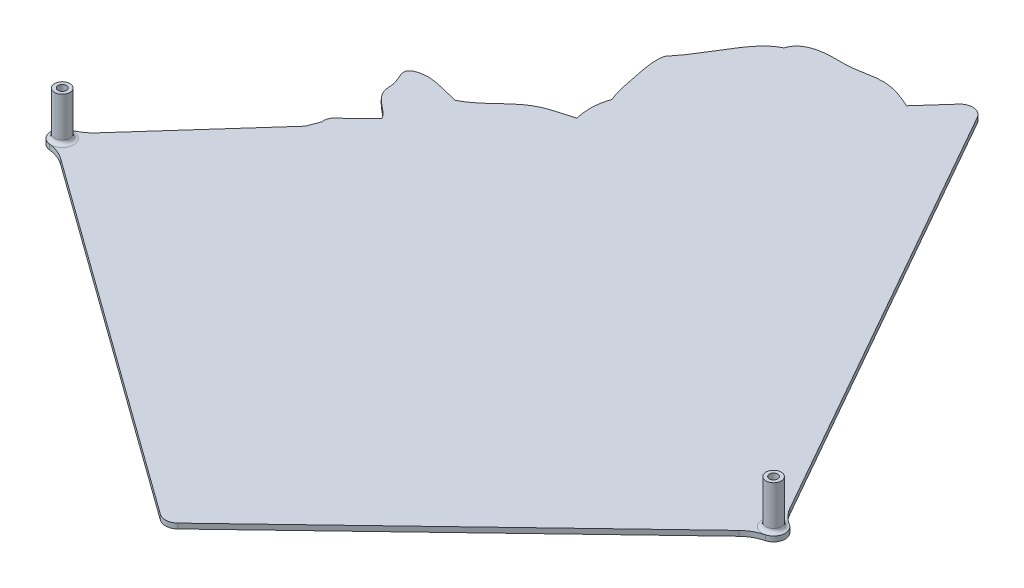
ISO-10303-21;
HEADER;
FILE_DESCRIPTION(('STEP AP214'),'2;1');
FILE_NAME('part.step','',(''),(''),'','','');
FILE_SCHEMA(('AUTOMOTIVE_DESIGN { 1 0 10303 214 1 1 1 1 }'));
ENDSEC;
DATA;
#1=APPLICATION_CONTEXT('core data for automotive mechanical design processes');
#2=APPLICATION_PROTOCOL_DEFINITION('international standard','automotive_design',2000,#1);
#3=PRODUCT_CONTEXT('',#1,'mechanical');
#4=PRODUCT('Part','Part','',(#3));
#5=PRODUCT_RELATED_PRODUCT_CATEGORY('part','',(#4));
#6=PRODUCT_DEFINITION_FORMATION('','',#4);
#7=PRODUCT_DEFINITION_CONTEXT('part definition',#1,'design');
#8=PRODUCT_DEFINITION('design','',#6,#7);
#9=PRODUCT_DEFINITION_SHAPE('','',#8);
#10=(LENGTH_UNIT() NAMED_UNIT(*) SI_UNIT(.MILLI.,.METRE.));
#11=(NAMED_UNIT(*) PLANE_ANGLE_UNIT() SI_UNIT($,.RADIAN.));
#12=(NAMED_UNIT(*) SI_UNIT($,.STERADIAN.) SOLID_ANGLE_UNIT());
#13=UNCERTAINTY_MEASURE_WITH_UNIT(LENGTH_MEASURE(1.E-05),#10,'distance_accuracy_value','');
#14=(GEOMETRIC_REPRESENTATION_CONTEXT(3) GLOBAL_UNCERTAINTY_ASSIGNED_CONTEXT((#13)) GLOBAL_UNIT_ASSIGNED_CONTEXT((#10,
#11,#12)) REPRESENTATION_CONTEXT('',''));
#15=CARTESIAN_POINT('',(0.,0.,0.));
#16=DIRECTION('',(0.,0.,1.));
#17=DIRECTION('',(1.,0.,0.));
#18=AXIS2_PLACEMENT_3D('',#15,#16,#17);
#19=CARTESIAN_POINT('',(50.312065061751,143.565722281243,204.420613873593));
#20=CARTESIAN_POINT('',(49.8157199251509,143.565722281243,202.125692191697));
#21=CARTESIAN_POINT('',(51.5600447655036,143.565722281243,200.071289123139));
#22=CARTESIAN_POINT('',(53.4054148893703,143.565722281243,199.000816342688));
#23=B_SPLINE_CURVE_WITH_KNOTS('',3,(#19,#20,#21,#22),.UNSPECIFIED.,.F.,.F.,(4,4),(0.,1.),.UNSPECIFIED.);
#24=DIRECTION('',(0.,-1.,0.));
#25=VECTOR('',#24,1.);
#26=SURFACE_OF_LINEAR_EXTRUSION('',#23,#25);
#27=CARTESIAN_POINT('',(50.312065061751,141.565722281243,204.420613873593));
#28=CARTESIAN_POINT('',(49.8157199251509,141.565722281243,202.125692191697));
#29=CARTESIAN_POINT('',(51.5600447655036,141.565722281243,200.071289123139));
#30=CARTESIAN_POINT('',(53.4054148893703,141.565722281243,199.000816342688));
#31=B_SPLINE_CURVE_WITH_KNOTS('',3,(#27,#28,#29,#30),.UNSPECIFIED.,.F.,.F.,(4,4),(0.,1.),.UNSPECIFIED.);
#32=CARTESIAN_POINT('',(50.312065061751,141.565722281243,204.420613873593));
#33=VERTEX_POINT('',#32);
#34=CARTESIAN_POINT('',(53.4054149393439,141.565722281243,199.000816290674));
#35=VERTEX_POINT('',#34);
#36=EDGE_CURVE('E225',#33,#35,#31,.T.);
#37=ORIENTED_EDGE('',*,*,#36,.F.);
#38=DIRECTION('',(0.,-1.,0.));
#39=VECTOR('',#38,1.);
#40=CARTESIAN_POINT('',(50.312065061751,143.565722281243,204.420613873593));
#41=LINE('',#40,#39);
#42=CARTESIAN_POINT('',(50.312065061751,143.565722281243,204.420613873593));
#43=VERTEX_POINT('',#42);
#44=EDGE_CURVE('E57',#43,#33,#41,.T.);
#45=ORIENTED_EDGE('',*,*,#44,.F.);
#46=CARTESIAN_POINT('',(53.4054149393439,143.565722281243,199.000816290674));
#47=VERTEX_POINT('',#46);
#48=EDGE_CURVE('E329',#43,#47,#23,.T.);
#49=ORIENTED_EDGE('',*,*,#48,.T.);
#50=DIRECTION('',(0.,-1.,0.));
#51=VECTOR('',#50,1.);
#52=CARTESIAN_POINT('',(53.4054149393439,143.565722281243,199.000816290674));
#53=LINE('',#52,#51);
#54=EDGE_CURVE('E140',#47,#35,#53,.T.);
#55=ORIENTED_EDGE('',*,*,#54,.T.);
#56=EDGE_LOOP('',(#37,#45,#49,#55));
#57=FACE_BOUND('',#56,.T.);
#58=ADVANCED_FACE('F39',(#57),#26,.T.);
#59=CARTESIAN_POINT('',(186.194143544738,143.565722281243,257.45630912643));
#60=DIRECTION('',(0.,-1.,0.));
#61=DIRECTION('',(0.,0.,-1.));
#62=AXIS2_PLACEMENT_3D('',#59,#60,#61);
#63=CYLINDRICAL_SURFACE('',#62,145.865431901491);
#64=CARTESIAN_POINT('',(186.194143544738,141.565722281243,257.45630912643));
#65=DIRECTION('',(0.,-1.,0.));
#66=DIRECTION('',(0.,0.,-1.));
#67=AXIS2_PLACEMENT_3D('',#64,#65,#66);
#68=CIRCLE('',#67,145.865431901491);
#69=CARTESIAN_POINT('',(48.5809578506154,141.565722281243,209.08963313021));
#70=VERTEX_POINT('',#69);
#71=EDGE_CURVE('E326',#70,#33,#68,.T.);
#72=ORIENTED_EDGE('',*,*,#71,.F.);
#73=DIRECTION('',(0.,-1.,0.));
#74=VECTOR('',#73,1.);
#75=CARTESIAN_POINT('',(48.5809578506154,143.565722281243,209.08963313021));
#76=LINE('',#75,#74);
#77=CARTESIAN_POINT('',(48.5809578506154,143.565722281243,209.08963313021));
#78=VERTEX_POINT('',#77);
#79=EDGE_CURVE('E128',#78,#70,#76,.T.);
#80=ORIENTED_EDGE('',*,*,#79,.F.);
#81=CARTESIAN_POINT('',(186.194143544738,143.565722281243,257.45630912643));
#82=DIRECTION('',(0.,-1.,0.));
#83=DIRECTION('',(0.,0.,-1.));
#84=AXIS2_PLACEMENT_3D('',#81,#82,#83);
#85=CIRCLE('',#84,145.865431901491);
#86=EDGE_CURVE('E214',#78,#43,#85,.T.);
#87=ORIENTED_EDGE('',*,*,#86,.T.);
#88=ORIENTED_EDGE('',*,*,#44,.T.);
#89=EDGE_LOOP('',(#72,#80,#87,#88));
#90=FACE_BOUND('',#89,.T.);
#91=ADVANCED_FACE('F429',(#90),#63,.T.);
#92=CARTESIAN_POINT('',(9.9157680601121,143.565722281243,252.305318893881));
#93=DIRECTION('',(-0.745253965464454,0.,-0.666780718797047));
#94=DIRECTION('',(-0.666780718797046,0.,0.745253965464454));
#95=AXIS2_PLACEMENT_3D('',#92,#93,#94);
#96=PLANE('',#95);
#97=DIRECTION('',(0.666780718797046,0.,-0.745253965464454));
#98=VECTOR('',#97,1.);
#99=CARTESIAN_POINT('',(9.9157680601121,141.565722281243,252.305318893881));
#100=LINE('',#99,#98);
#101=CARTESIAN_POINT('',(9.91576806011209,141.565722281243,252.305318893881));
#102=VERTEX_POINT('',#101);
#103=EDGE_CURVE('E201',#102,#70,#100,.T.);
#104=ORIENTED_EDGE('',*,*,#103,.F.);
#105=DIRECTION('',(0.,-1.,0.));
#106=VECTOR('',#105,1.);
#107=CARTESIAN_POINT('',(9.91576806011209,143.565722281243,252.305318893881));
#108=LINE('',#107,#106);
#109=CARTESIAN_POINT('',(9.91576806011209,143.565722281243,252.305318893881));
#110=VERTEX_POINT('',#109);
#111=EDGE_CURVE('E196',#110,#102,#108,.T.);
#112=ORIENTED_EDGE('',*,*,#111,.F.);
#113=DIRECTION('',(0.666780718797046,0.,-0.745253965464454));
#114=VECTOR('',#113,1.);
#115=CARTESIAN_POINT('',(9.9157680601121,143.565722281243,252.305318893881));
#116=LINE('',#115,#114);
#117=EDGE_CURVE('E199',#110,#78,#116,.T.);
#118=ORIENTED_EDGE('',*,*,#117,.T.);
#119=ORIENTED_EDGE('',*,*,#79,.T.);
#120=EDGE_LOOP('',(#104,#112,#118,#119));
#121=FACE_BOUND('',#120,.T.);
#122=ADVANCED_FACE('F198',(#121),#96,.T.);
#123=CARTESIAN_POINT('',(-1.2630414218547,143.565722281243,242.303608111926));
#124=DIRECTION('',(0.,-1.,0.));
#125=DIRECTION('',(0.,0.,-1.));
#126=AXIS2_PLACEMENT_3D('',#123,#124,#125);
#127=CYLINDRICAL_SURFACE('',#126,15.);
#128=CARTESIAN_POINT('',(-1.2630414218547,141.565722281243,242.303608111926));
#129=DIRECTION('',(0.,1.,0.));
#130=DIRECTION('',(0.,0.,-1.));
#131=AXIS2_PLACEMENT_3D('',#128,#129,#130);
#132=CIRCLE('',#131,15.);
#133=CARTESIAN_POINT('',(3.58303822424979,141.565722281243,256.499224057126));
#134=VERTEX_POINT('',#133);
#135=EDGE_CURVE('E323',#134,#102,#132,.T.);
#136=ORIENTED_EDGE('',*,*,#135,.F.);
#137=DIRECTION('',(0.,-1.,0.));
#138=VECTOR('',#137,1.);
#139=CARTESIAN_POINT('',(3.58303822424979,143.565722281243,256.499224057126));
#140=LINE('',#139,#138);
#141=CARTESIAN_POINT('',(3.58303822424979,143.565722281243,256.499224057126));
#142=VERTEX_POINT('',#141);
#143=EDGE_CURVE('E206',#142,#134,#140,.T.);
#144=ORIENTED_EDGE('',*,*,#143,.F.);
#145=CARTESIAN_POINT('',(-1.2630414218547,143.565722281243,242.303608111926));
#146=DIRECTION('',(0.,1.,0.));
#147=DIRECTION('',(0.,0.,-1.));
#148=AXIS2_PLACEMENT_3D('',#145,#146,#147);
#149=CIRCLE('',#148,15.);
#150=EDGE_CURVE('E212',#142,#110,#149,.T.);
#151=ORIENTED_EDGE('',*,*,#150,.T.);
#152=ORIENTED_EDGE('',*,*,#111,.T.);
#153=EDGE_LOOP('',(#136,#144,#151,#152));
#154=FACE_BOUND('',#153,.T.);
#155=ADVANCED_FACE('F217',(#154),#127,.F.);
#156=CARTESIAN_POINT('',(5.03686211808113,143.565722281243,260.757908840686));
#157=DIRECTION('',(0.,-1.,0.));
#158=DIRECTION('',(0.,0.,-1.));
#159=AXIS2_PLACEMENT_3D('',#156,#157,#158);
#160=CYLINDRICAL_SURFACE('',#159,4.5);
#161=CARTESIAN_POINT('',(5.03686211808113,141.565722281243,260.757908840686));
#162=DIRECTION('',(0.,-1.,0.));
#163=DIRECTION('',(0.,0.,-1.));
#164=AXIS2_PLACEMENT_3D('',#161,#162,#163);
#165=CIRCLE('',#164,4.5);
#166=CARTESIAN_POINT('',(4.52972957723509,141.565722281243,265.229241593458));
#167=VERTEX_POINT('',#166);
#168=EDGE_CURVE('E320',#167,#134,#165,.T.);
#169=ORIENTED_EDGE('',*,*,#168,.F.);
#170=DIRECTION('',(0.,-1.,0.));
#171=VECTOR('',#170,1.);
#172=CARTESIAN_POINT('',(4.52972957723509,143.565722281243,265.229241593458));
#173=LINE('',#172,#171);
#174=CARTESIAN_POINT('',(4.52972957723509,143.565722281243,265.229241593458));
#175=VERTEX_POINT('',#174);
#176=EDGE_CURVE('E334',#175,#167,#173,.T.);
#177=ORIENTED_EDGE('',*,*,#176,.F.);
#178=CARTESIAN_POINT('',(5.03686211808113,143.565722281243,260.757908840686));
#179=DIRECTION('',(0.,-1.,0.));
#180=DIRECTION('',(0.,0.,-1.));
#181=AXIS2_PLACEMENT_3D('',#178,#179,#180);
#182=CIRCLE('',#181,4.5);
#183=EDGE_CURVE('E218',#175,#142,#182,.T.);
#184=ORIENTED_EDGE('',*,*,#183,.T.);
#185=ORIENTED_EDGE('',*,*,#143,.T.);
#186=EDGE_LOOP('',(#169,#177,#184,#185));
#187=FACE_BOUND('',#186,.T.);
#188=ADVANCED_FACE('F481',(#187),#160,.T.);
#189=CARTESIAN_POINT('',(2.83928777441497,143.565722281243,280.133684102699));
#190=DIRECTION('',(0.,-1.,0.));
#191=DIRECTION('',(0.,0.,-1.));
#192=AXIS2_PLACEMENT_3D('',#189,#190,#191);
#193=CYLINDRICAL_SURFACE('',#192,15.);
#194=CARTESIAN_POINT('',(2.83928777441497,141.565722281243,280.133684102699));
#195=DIRECTION('',(0.,1.,0.));
#196=DIRECTION('',(0.,0.,-1.));
#197=AXIS2_PLACEMENT_3D('',#194,#195,#196);
#198=CIRCLE('',#197,15.);
#199=CARTESIAN_POINT('',(11.6142620209908,141.565722281243,267.968166153515));
#200=VERTEX_POINT('',#199);
#201=EDGE_CURVE('E317',#200,#167,#198,.T.);
#202=ORIENTED_EDGE('',*,*,#201,.F.);
#203=DIRECTION('',(0.,-1.,0.));
#204=VECTOR('',#203,1.);
#205=CARTESIAN_POINT('',(11.6142620209908,143.565722281243,267.968166153515));
#206=LINE('',#205,#204);
#207=CARTESIAN_POINT('',(11.6142620209908,143.565722281243,267.968166153515));
#208=VERTEX_POINT('',#207);
#209=EDGE_CURVE('E336',#208,#200,#206,.T.);
#210=ORIENTED_EDGE('',*,*,#209,.F.);
#211=CARTESIAN_POINT('',(2.83928777441497,143.565722281243,280.133684102699));
#212=DIRECTION('',(0.,1.,0.));
#213=DIRECTION('',(0.,0.,-1.));
#214=AXIS2_PLACEMENT_3D('',#211,#212,#213);
#215=CIRCLE('',#214,15.);
#216=EDGE_CURVE('E220',#208,#175,#215,.T.);
#217=ORIENTED_EDGE('',*,*,#216,.T.);
#218=ORIENTED_EDGE('',*,*,#176,.T.);
#219=EDGE_LOOP('',(#202,#210,#217,#218));
#220=FACE_BOUND('',#219,.T.);
#221=ADVANCED_FACE('F484',(#220),#193,.F.);
#222=CARTESIAN_POINT('',(151.733177312439,143.565722281243,369.035780230975));
#223=DIRECTION('',(-0.584998283105054,0.,0.811034529945636));
#224=DIRECTION('',(0.811034529945636,0.,0.584998283105054));
#225=AXIS2_PLACEMENT_3D('',#222,#223,#224);
#226=PLANE('',#225);
#227=DIRECTION('',(-0.811034529945636,0.,-0.584998283105054));
#228=VECTOR('',#227,1.);
#229=CARTESIAN_POINT('',(151.733177312439,141.565722281243,369.035780230975));
#230=LINE('',#229,#228);
#231=CARTESIAN_POINT('',(151.733177312439,141.565722281243,369.035780230975));
#232=VERTEX_POINT('',#231);
#233=EDGE_CURVE('E314',#232,#200,#230,.T.);
#234=ORIENTED_EDGE('',*,*,#233,.F.);
#235=DIRECTION('',(0.,-1.,0.));
#236=VECTOR('',#235,1.);
#237=CARTESIAN_POINT('',(151.733177312439,143.565722281243,369.035780230975));
#238=LINE('',#237,#236);
#239=CARTESIAN_POINT('',(151.733177312439,143.565722281243,369.035780230975));
#240=VERTEX_POINT('',#239);
#241=EDGE_CURVE('E338',#240,#232,#238,.T.);
#242=ORIENTED_EDGE('',*,*,#241,.F.);
#243=DIRECTION('',(-0.811034529945636,0.,-0.584998283105054));
#244=VECTOR('',#243,1.);
#245=CARTESIAN_POINT('',(151.733177312439,143.565722281243,369.035780230975));
#246=LINE('',#245,#244);
#247=EDGE_CURVE('E571',#240,#208,#246,.T.);
#248=ORIENTED_EDGE('',*,*,#247,.T.);
#249=ORIENTED_EDGE('',*,*,#209,.T.);
#250=EDGE_LOOP('',(#234,#242,#248,#249));
#251=FACE_BOUND('',#250,.T.);
#252=ADVANCED_FACE('F488',(#251),#226,.T.);
#253=CARTESIAN_POINT('',(154.658168727966,143.565722281243,364.980607581246));
#254=DIRECTION('',(0.,-1.,0.));
#255=DIRECTION('',(0.,0.,-1.));
#256=AXIS2_PLACEMENT_3D('',#253,#254,#255);
#257=CYLINDRICAL_SURFACE('',#256,5.0000000000008);
#258=CARTESIAN_POINT('',(154.658168727966,141.565722281243,364.980607581246));
#259=DIRECTION('',(0.,-1.,0.));
#260=DIRECTION('',(0.,0.,-1.));
#261=AXIS2_PLACEMENT_3D('',#258,#259,#260);
#262=CIRCLE('',#261,5.0000000000008);
#263=CARTESIAN_POINT('',(158.11296422805,141.565722281243,368.595076844168));
#264=VERTEX_POINT('',#263);
#265=EDGE_CURVE('E311',#264,#232,#262,.T.);
#266=ORIENTED_EDGE('',*,*,#265,.F.);
#267=DIRECTION('',(0.,-1.,0.));
#268=VECTOR('',#267,1.);
#269=CARTESIAN_POINT('',(158.11296422805,143.565722281243,368.595076844168));
#270=LINE('',#269,#268);
#271=CARTESIAN_POINT('',(158.11296422805,143.565722281243,368.595076844168));
#272=VERTEX_POINT('',#271);
#273=EDGE_CURVE('E340',#272,#264,#270,.T.);
#274=ORIENTED_EDGE('',*,*,#273,.F.);
#275=CARTESIAN_POINT('',(154.658168727966,143.565722281243,364.980607581246));
#276=DIRECTION('',(0.,-1.,0.));
#277=DIRECTION('',(0.,0.,-1.));
#278=AXIS2_PLACEMENT_3D('',#275,#276,#277);
#279=CIRCLE('',#278,5.0000000000008);
#280=EDGE_CURVE('E568',#272,#240,#279,.T.);
#281=ORIENTED_EDGE('',*,*,#280,.T.);
#282=ORIENTED_EDGE('',*,*,#241,.T.);
#283=EDGE_LOOP('',(#266,#274,#281,#282));
#284=FACE_BOUND('',#283,.T.);
#285=ADVANCED_FACE('F492',(#284),#257,.T.);
#286=CARTESIAN_POINT('',(270.382479394317,143.565722281243,261.285209868104));
#287=DIRECTION('',(0.690959100016867,0.,0.722893852584099));
#288=DIRECTION('',(0.722893852584099,0.,-0.690959100016867));
#289=AXIS2_PLACEMENT_3D('',#286,#287,#288);
#290=PLANE('',#289);
#291=DIRECTION('',(-0.722893852584099,0.,0.690959100016867));
#292=VECTOR('',#291,1.);
#293=CARTESIAN_POINT('',(270.382479394317,141.565722281243,261.285209868104));
#294=LINE('',#293,#292);
#295=CARTESIAN_POINT('',(270.382479394317,141.565722281243,261.285209868104));
#296=VERTEX_POINT('',#295);
#297=EDGE_CURVE('E308',#296,#264,#294,.T.);
#298=ORIENTED_EDGE('',*,*,#297,.F.);
#299=DIRECTION('',(0.,-1.,0.));
#300=VECTOR('',#299,1.);
#301=CARTESIAN_POINT('',(270.382479394317,143.565722281243,261.285209868104));
#302=LINE('',#301,#300);
#303=CARTESIAN_POINT('',(270.382479394317,143.565722281243,261.285209868104));
#304=VERTEX_POINT('',#303);
#305=EDGE_CURVE('E342',#304,#296,#302,.T.);
#306=ORIENTED_EDGE('',*,*,#305,.F.);
#307=DIRECTION('',(-0.722893852584099,0.,0.690959100016867));
#308=VECTOR('',#307,1.);
#309=CARTESIAN_POINT('',(270.382479394317,143.565722281243,261.285209868104));
#310=LINE('',#309,#308);
#311=EDGE_CURVE('E565',#304,#272,#310,.T.);
#312=ORIENTED_EDGE('',*,*,#311,.T.);
#313=ORIENTED_EDGE('',*,*,#273,.T.);
#314=EDGE_LOOP('',(#298,#306,#312,#313));
#315=FACE_BOUND('',#314,.T.);
#316=ADVANCED_FACE('F496',(#315),#290,.T.);
#317=CARTESIAN_POINT('',(280.74686589457,143.565722281243,272.128617656866));
#318=DIRECTION('',(0.,-1.,0.));
#319=DIRECTION('',(0.,0.,-1.));
#320=AXIS2_PLACEMENT_3D('',#317,#318,#319);
#321=CYLINDRICAL_SURFACE('',#320,15.);
#322=CARTESIAN_POINT('',(280.74686589457,141.565722281243,272.128617656866));
#323=DIRECTION('',(0.,1.,0.));
#324=DIRECTION('',(0.,0.,-1.));
#325=AXIS2_PLACEMENT_3D('',#322,#323,#324);
#326=CIRCLE('',#325,15.);
#327=CARTESIAN_POINT('',(277.023119071912,141.565722281243,257.598176865178));
#328=VERTEX_POINT('',#327);
#329=EDGE_CURVE('E305',#328,#296,#326,.T.);
#330=ORIENTED_EDGE('',*,*,#329,.F.);
#331=DIRECTION('',(0.,-1.,0.));
#332=VECTOR('',#331,1.);
#333=CARTESIAN_POINT('',(277.023119071912,143.565722281243,257.598176865178));
#334=LINE('',#333,#332);
#335=CARTESIAN_POINT('',(277.023119071912,143.565722281243,257.598176865178));
#336=VERTEX_POINT('',#335);
#337=EDGE_CURVE('E344',#336,#328,#334,.T.);
#338=ORIENTED_EDGE('',*,*,#337,.F.);
#339=CARTESIAN_POINT('',(280.74686589457,143.565722281243,272.128617656866));
#340=DIRECTION('',(0.,1.,0.));
#341=DIRECTION('',(0.,0.,-1.));
#342=AXIS2_PLACEMENT_3D('',#339,#340,#341);
#343=CIRCLE('',#342,15.);
#344=EDGE_CURVE('E562',#336,#304,#343,.T.);
#345=ORIENTED_EDGE('',*,*,#344,.T.);
#346=ORIENTED_EDGE('',*,*,#305,.T.);
#347=EDGE_LOOP('',(#330,#338,#345,#346));
#348=FACE_BOUND('',#347,.T.);
#349=ADVANCED_FACE('F500',(#348),#321,.F.);
#350=CARTESIAN_POINT('',(275.905995025114,143.565722281243,253.239044627672));
#351=DIRECTION('',(0.,-1.,0.));
#352=DIRECTION('',(0.,0.,-1.));
#353=AXIS2_PLACEMENT_3D('',#350,#351,#352);
#354=CYLINDRICAL_SURFACE('',#353,4.50000000000003);
#355=CARTESIAN_POINT('',(275.905995025114,141.565722281243,253.239044627672));
#356=DIRECTION('',(0.,-1.,0.));
#357=DIRECTION('',(0.,0.,-1.));
#358=AXIS2_PLACEMENT_3D('',#355,#356,#357);
#359=CIRCLE('',#358,4.50000000000003);
#360=CARTESIAN_POINT('',(278.233009090411,141.565722281243,249.387420873991));
#361=VERTEX_POINT('',#360);
#362=EDGE_CURVE('E302',#361,#328,#359,.T.);
#363=ORIENTED_EDGE('',*,*,#362,.F.);
#364=DIRECTION('',(0.,-1.,0.));
#365=VECTOR('',#364,1.);
#366=CARTESIAN_POINT('',(278.233009090411,143.565722281243,249.387420873991));
#367=LINE('',#366,#365);
#368=CARTESIAN_POINT('',(278.233009090411,143.565722281243,249.387420873991));
#369=VERTEX_POINT('',#368);
#370=EDGE_CURVE('E346',#369,#361,#367,.T.);
#371=ORIENTED_EDGE('',*,*,#370,.F.);
#372=CARTESIAN_POINT('',(275.905995025114,143.565722281243,253.239044627672));
#373=DIRECTION('',(0.,-1.,0.));
#374=DIRECTION('',(0.,0.,-1.));
#375=AXIS2_PLACEMENT_3D('',#372,#373,#374);
#376=CIRCLE('',#375,4.50000000000003);
#377=EDGE_CURVE('E559',#369,#336,#376,.T.);
#378=ORIENTED_EDGE('',*,*,#377,.T.);
#379=ORIENTED_EDGE('',*,*,#337,.T.);
#380=EDGE_LOOP('',(#363,#371,#378,#379));
#381=FACE_BOUND('',#380,.T.);
#382=ADVANCED_FACE('F504',(#381),#354,.T.);
#383=CARTESIAN_POINT('',(285.989722641398,143.565722281243,236.548675028391));
#384=DIRECTION('',(0.,-1.,0.));
#385=DIRECTION('',(0.,0.,-1.));
#386=AXIS2_PLACEMENT_3D('',#383,#384,#385);
#387=CYLINDRICAL_SURFACE('',#386,15.);
#388=CARTESIAN_POINT('',(285.989722641398,141.565722281243,236.548675028391));
#389=DIRECTION('',(0.,1.,0.));
#390=DIRECTION('',(0.,0.,-1.));
#391=AXIS2_PLACEMENT_3D('',#388,#389,#390);
#392=CIRCLE('',#391,15.);
#393=CARTESIAN_POINT('',(272.938128905281,141.565722281243,243.941637962652));
#394=VERTEX_POINT('',#393);
#395=EDGE_CURVE('E299',#394,#361,#392,.T.);
#396=ORIENTED_EDGE('',*,*,#395,.F.);
#397=DIRECTION('',(0.,-1.,0.));
#398=VECTOR('',#397,1.);
#399=CARTESIAN_POINT('',(272.938128905281,143.565722281243,243.941637962652));
#400=LINE('',#399,#398);
#401=CARTESIAN_POINT('',(272.938128905281,143.565722281243,243.941637962652));
#402=VERTEX_POINT('',#401);
#403=EDGE_CURVE('E348',#402,#394,#400,.T.);
#404=ORIENTED_EDGE('',*,*,#403,.F.);
#405=CARTESIAN_POINT('',(285.989722641398,143.565722281243,236.548675028391));
#406=DIRECTION('',(0.,1.,0.));
#407=DIRECTION('',(0.,0.,-1.));
#408=AXIS2_PLACEMENT_3D('',#405,#406,#407);
#409=CIRCLE('',#408,15.);
#410=EDGE_CURVE('E556',#402,#369,#409,.T.);
#411=ORIENTED_EDGE('',*,*,#410,.T.);
#412=ORIENTED_EDGE('',*,*,#370,.T.);
#413=EDGE_LOOP('',(#396,#404,#411,#412));
#414=FACE_BOUND('',#413,.T.);
#415=ADVANCED_FACE('F508',(#414),#387,.F.);
#416=CARTESIAN_POINT('',(177.033466994831,143.565722281243,74.6308087612831));
#417=DIRECTION('',(0.870106249074433,0.,-0.492864195617434));
#418=DIRECTION('',(-0.492864195617434,0.,-0.870106249074433));
#419=AXIS2_PLACEMENT_3D('',#416,#417,#418);
#420=PLANE('',#419);
#421=DIRECTION('',(0.492864195617434,0.,0.870106249074433));
#422=VECTOR('',#421,1.);
#423=CARTESIAN_POINT('',(177.033466994831,141.565722281243,74.6308087612831));
#424=LINE('',#423,#422);
#425=CARTESIAN_POINT('',(177.033466994831,141.565722281243,74.630808761283));
#426=VERTEX_POINT('',#425);
#427=EDGE_CURVE('E296',#426,#394,#424,.T.);
#428=ORIENTED_EDGE('',*,*,#427,.F.);
#429=DIRECTION('',(0.,-1.,0.));
#430=VECTOR('',#429,1.);
#431=CARTESIAN_POINT('',(177.033466994831,143.565722281243,74.630808761283));
#432=LINE('',#431,#430);
#433=CARTESIAN_POINT('',(177.033466994831,143.565722281243,74.630808761283));
#434=VERTEX_POINT('',#433);
#435=EDGE_CURVE('E350',#434,#426,#432,.T.);
#436=ORIENTED_EDGE('',*,*,#435,.F.);
#437=DIRECTION('',(0.492864195617434,0.,0.870106249074433));
#438=VECTOR('',#437,1.);
#439=CARTESIAN_POINT('',(177.033466994831,143.565722281243,74.6308087612831));
#440=LINE('',#439,#438);
#441=EDGE_CURVE('E553',#434,#402,#440,.T.);
#442=ORIENTED_EDGE('',*,*,#441,.T.);
#443=ORIENTED_EDGE('',*,*,#403,.T.);
#444=EDGE_LOOP('',(#428,#436,#442,#443));
#445=FACE_BOUND('',#444,.T.);
#446=ADVANCED_FACE('F512',(#445),#420,.T.);
#447=CARTESIAN_POINT('',(172.68293574946,143.565722281243,77.0951297393725));
#448=DIRECTION('',(0.,-1.,0.));
#449=DIRECTION('',(0.,0.,-1.));
#450=AXIS2_PLACEMENT_3D('',#447,#448,#449);
#451=CYLINDRICAL_SURFACE('',#450,5.00000000000021);
#452=CARTESIAN_POINT('',(172.68293574946,141.565722281243,77.0951297393725));
#453=DIRECTION('',(0.,-1.,0.));
#454=DIRECTION('',(0.,0.,-1.));
#455=AXIS2_PLACEMENT_3D('',#452,#453,#454);
#456=CIRCLE('',#455,5.00000000000021);
#457=CARTESIAN_POINT('',(168.955344377848,141.565722281243,73.7627038112705));
#458=VERTEX_POINT('',#457);
#459=EDGE_CURVE('E293',#458,#426,#456,.T.);
#460=ORIENTED_EDGE('',*,*,#459,.F.);
#461=DIRECTION('',(0.,-1.,0.));
#462=VECTOR('',#461,1.);
#463=CARTESIAN_POINT('',(168.955344377848,143.565722281243,73.7627038112705));
#464=LINE('',#463,#462);
#465=CARTESIAN_POINT('',(168.955344377848,143.565722281243,73.7627038112705));
#466=VERTEX_POINT('',#465);
#467=EDGE_CURVE('E352',#466,#458,#464,.T.);
#468=ORIENTED_EDGE('',*,*,#467,.F.);
#469=CARTESIAN_POINT('',(172.68293574946,143.565722281243,77.0951297393725));
#470=DIRECTION('',(0.,-1.,0.));
#471=DIRECTION('',(0.,0.,-1.));
#472=AXIS2_PLACEMENT_3D('',#469,#470,#471);
#473=CIRCLE('',#472,5.00000000000021);
#474=EDGE_CURVE('E550',#466,#434,#473,.T.);
#475=ORIENTED_EDGE('',*,*,#474,.T.);
#476=ORIENTED_EDGE('',*,*,#435,.T.);
#477=EDGE_LOOP('',(#460,#468,#475,#476));
#478=FACE_BOUND('',#477,.T.);
#479=ADVANCED_FACE('F516',(#478),#451,.T.);
#480=CARTESIAN_POINT('',(159.2724588231,143.565722281243,84.5938044643456));
#481=DIRECTION('',(-0.745518274322404,0.,-0.666485185620314));
#482=DIRECTION('',(-0.666485185620314,0.,0.745518274322404));
#483=AXIS2_PLACEMENT_3D('',#480,#481,#482);
#484=PLANE('',#483);
#485=DIRECTION('',(0.666485185620314,0.,-0.745518274322404));
#486=VECTOR('',#485,1.);
#487=CARTESIAN_POINT('',(159.2724588231,141.565722281243,84.5938044643456));
#488=LINE('',#487,#486);
#489=CARTESIAN_POINT('',(159.2724588231,141.565722281243,84.5938044643456));
#490=VERTEX_POINT('',#489);
#491=EDGE_CURVE('E287',#490,#458,#488,.T.);
#492=ORIENTED_EDGE('',*,*,#491,.F.);
#493=DIRECTION('',(0.,-1.,0.));
#494=VECTOR('',#493,1.);
#495=CARTESIAN_POINT('',(159.2724588231,143.565722281243,84.5938044643456));
#496=LINE('',#495,#494);
#497=CARTESIAN_POINT('',(159.2724588231,143.565722281243,84.5938044643456));
#498=VERTEX_POINT('',#497);
#499=EDGE_CURVE('E354',#498,#490,#496,.T.);
#500=ORIENTED_EDGE('',*,*,#499,.F.);
#501=DIRECTION('',(0.666485185620314,0.,-0.745518274322404));
#502=VECTOR('',#501,1.);
#503=CARTESIAN_POINT('',(159.2724588231,143.565722281243,84.5938044643456));
#504=LINE('',#503,#502);
#505=EDGE_CURVE('E539',#498,#466,#504,.T.);
#506=ORIENTED_EDGE('',*,*,#505,.T.);
#507=ORIENTED_EDGE('',*,*,#467,.T.);
#508=EDGE_LOOP('',(#492,#500,#506,#507));
#509=FACE_BOUND('',#508,.T.);
#510=ADVANCED_FACE('F520',(#509),#484,.T.);
#511=CARTESIAN_POINT('',(115.654612237065,143.565722281243,88.9625501117511));
#512=CARTESIAN_POINT('',(117.154809763146,143.565722281243,84.078670542443));
#513=CARTESIAN_POINT('',(125.513466275061,143.565722281243,82.1440697555916));
#514=CARTESIAN_POINT('',(136.374508773782,143.565722281243,82.9185957961294));
#515=CARTESIAN_POINT('',(147.178985025419,143.565722281243,79.4553127811682));
#516=CARTESIAN_POINT('',(155.383750000118,143.565722281243,82.7877297082552));
#517=CARTESIAN_POINT('',(159.2724588231,143.565722281243,84.5938044643456));
#518=B_SPLINE_CURVE_WITH_KNOTS('',3,(#511,#512,#513,#514,#515,#516,#517),.UNSPECIFIED.,.F.,.F.,
(4,1,1,1,4),(0.,0.302255881697725,0.465040863119109,0.717430044194612,1.),.UNSPECIFIED.);
#519=DIRECTION('',(0.,-1.,0.));
#520=VECTOR('',#519,1.);
#521=SURFACE_OF_LINEAR_EXTRUSION('',#518,#520);
#522=CARTESIAN_POINT('',(115.654612237065,141.565722281243,88.9625501117511));
#523=CARTESIAN_POINT('',(117.154809763146,141.565722281243,84.078670542443));
#524=CARTESIAN_POINT('',(125.513466275061,141.565722281243,82.1440697555916));
#525=CARTESIAN_POINT('',(136.374508773782,141.565722281243,82.9185957961294));
#526=CARTESIAN_POINT('',(147.178985025419,141.565722281243,79.4553127811682));
#527=CARTESIAN_POINT('',(155.383750000118,141.565722281243,82.7877297082552));
#528=CARTESIAN_POINT('',(159.2724588231,141.565722281243,84.5938044643456));
#529=B_SPLINE_CURVE_WITH_KNOTS('',3,(#522,#523,#524,#525,#526,#527,#528),.UNSPECIFIED.,.F.,.F.,
(4,1,1,1,4),(0.,0.302255881697725,0.465040863119109,0.717430044194612,1.),.UNSPECIFIED.);
#530=CARTESIAN_POINT('',(115.654612237065,141.565722281243,88.9625501117511));
#531=VERTEX_POINT('',#530);
#532=EDGE_CURVE('E279',#531,#490,#529,.T.);
#533=ORIENTED_EDGE('',*,*,#532,.F.);
#534=DIRECTION('',(0.,-1.,0.));
#535=VECTOR('',#534,1.);
#536=CARTESIAN_POINT('',(115.654612237065,143.565722281243,88.9625501117511));
#537=LINE('',#536,#535);
#538=CARTESIAN_POINT('',(115.654612237065,143.565722281243,88.9625501117511));
#539=VERTEX_POINT('',#538);
#540=EDGE_CURVE('E356',#539,#531,#537,.T.);
#541=ORIENTED_EDGE('',*,*,#540,.F.);
#542=EDGE_CURVE('E533',#539,#498,#518,.T.);
#543=ORIENTED_EDGE('',*,*,#542,.T.);
#544=ORIENTED_EDGE('',*,*,#499,.T.);
#545=EDGE_LOOP('',(#533,#541,#543,#544));
#546=FACE_BOUND('',#545,.T.);
#547=ADVANCED_FACE('F524',(#546),#521,.T.);
#548=CARTESIAN_POINT('',(95.1286297814479,143.565722281243,115.204359992126));
#549=CARTESIAN_POINT('',(99.5313596620538,143.565722281243,110.027059936132));
#550=CARTESIAN_POINT('',(104.66045626971,143.565722281243,100.101106742437));
#551=CARTESIAN_POINT('',(111.483774880251,143.565722281243,91.0179286750574));
#552=CARTESIAN_POINT('',(115.654612237065,143.565722281243,88.9625501117511));
#553=B_SPLINE_CURVE_WITH_KNOTS('',3,(#548,#549,#550,#551,#552),.UNSPECIFIED.,.F.,.F.,(4,1,4),
(0.,0.601104084779455,1.),.UNSPECIFIED.);
#554=DIRECTION('',(0.,-1.,0.));
#555=VECTOR('',#554,1.);
#556=SURFACE_OF_LINEAR_EXTRUSION('',#553,#555);
#557=CARTESIAN_POINT('',(95.1286297814479,141.565722281243,115.204359992126));
#558=CARTESIAN_POINT('',(99.5313596620538,141.565722281243,110.027059936132));
#559=CARTESIAN_POINT('',(104.66045626971,141.565722281243,100.101106742437));
#560=CARTESIAN_POINT('',(111.483774880251,141.565722281243,91.0179286750574));
#561=CARTESIAN_POINT('',(115.654612237065,141.565722281243,88.9625501117511));
#562=B_SPLINE_CURVE_WITH_KNOTS('',3,(#557,#558,#559,#560,#561),.UNSPECIFIED.,.F.,.F.,(4,1,4),
(0.,0.601104084779455,1.),.UNSPECIFIED.);
#563=CARTESIAN_POINT('',(95.1286297814479,141.565722281243,115.204359992126));
#564=VERTEX_POINT('',#563);
#565=EDGE_CURVE('E271',#564,#531,#562,.T.);
#566=ORIENTED_EDGE('',*,*,#565,.F.);
#567=DIRECTION('',(0.,-1.,0.));
#568=VECTOR('',#567,1.);
#569=CARTESIAN_POINT('',(95.1286297814479,143.565722281243,115.204359992126));
#570=LINE('',#569,#568);
#571=CARTESIAN_POINT('',(95.1286297814479,143.565722281243,115.204359992126));
#572=VERTEX_POINT('',#571);
#573=EDGE_CURVE('E358',#572,#564,#570,.T.);
#574=ORIENTED_EDGE('',*,*,#573,.F.);
#575=EDGE_CURVE('E540',#572,#539,#553,.T.);
#576=ORIENTED_EDGE('',*,*,#575,.T.);
#577=ORIENTED_EDGE('',*,*,#540,.T.);
#578=EDGE_LOOP('',(#566,#574,#576,#577));
#579=FACE_BOUND('',#578,.T.);
#580=ADVANCED_FACE('F529',(#579),#556,.T.);
#581=CARTESIAN_POINT('',(99.5004462969957,143.565722281243,140.061549094134));
#582=CARTESIAN_POINT('',(97.7553652454209,143.565722281243,136.29700673007));
#583=CARTESIAN_POINT('',(96.6081538734198,143.565722281243,127.913172296152));
#584=CARTESIAN_POINT('',(94.3637180487383,143.565722281243,119.605147547862));
#585=CARTESIAN_POINT('',(95.1286297814479,143.565722281243,115.204359992126));
#586=B_SPLINE_CURVE_WITH_KNOTS('',3,(#581,#582,#583,#584,#585),.UNSPECIFIED.,.F.,.F.,(4,1,4),
(0.,0.482786434707523,1.),.UNSPECIFIED.);
#587=DIRECTION('',(0.,-1.,0.));
#588=VECTOR('',#587,1.);
#589=SURFACE_OF_LINEAR_EXTRUSION('',#586,#588);
#590=CARTESIAN_POINT('',(99.5004462969957,141.565722281243,140.061549094134));
#591=CARTESIAN_POINT('',(97.7553652454209,141.565722281243,136.29700673007));
#592=CARTESIAN_POINT('',(96.6081538734198,141.565722281243,127.913172296152));
#593=CARTESIAN_POINT('',(94.3637180487383,141.565722281243,119.605147547862));
#594=CARTESIAN_POINT('',(95.1286297814479,141.565722281243,115.204359992126));
#595=B_SPLINE_CURVE_WITH_KNOTS('',3,(#590,#591,#592,#593,#594),.UNSPECIFIED.,.F.,.F.,(4,1,4),
(0.,0.482786434707523,1.),.UNSPECIFIED.);
#596=CARTESIAN_POINT('',(99.5004462981887,141.565722281243,140.061549090942));
#597=VERTEX_POINT('',#596);
#598=EDGE_CURVE('E263',#597,#564,#595,.T.);
#599=ORIENTED_EDGE('',*,*,#598,.F.);
#600=DIRECTION('',(0.,-1.,0.));
#601=VECTOR('',#600,1.);
#602=CARTESIAN_POINT('',(99.5004462981887,143.565722281243,140.061549090942));
#603=LINE('',#602,#601);
#604=CARTESIAN_POINT('',(99.5004462981887,143.565722281243,140.061549090942));
#605=VERTEX_POINT('',#604);
#606=EDGE_CURVE('E360',#605,#597,#603,.T.);
#607=ORIENTED_EDGE('',*,*,#606,.F.);
#608=EDGE_CURVE('E607',#605,#572,#586,.T.);
#609=ORIENTED_EDGE('',*,*,#608,.T.);
#610=ORIENTED_EDGE('',*,*,#573,.T.);
#611=EDGE_LOOP('',(#599,#607,#609,#610));
#612=FACE_BOUND('',#611,.T.);
#613=ADVANCED_FACE('F623',(#612),#589,.T.);
#614=CARTESIAN_POINT('',(998950.652514719,143.565722281243,48493.1412837098));
#615=CARTESIAN_POINT('',(-999029.730725042,143.565722281243,-41606.459605313));
#616=CARTESIAN_POINT('',(999501.72896305,143.565722281243,35306.1825821053));
#617=B_SPLINE_CURVE_WITH_KNOTS('',2,(#614,#615,#616),.UNSPECIFIED.,.F.,.F.,(3,3),(0.,1.),.UNSPECIFIED.);
#618=DIRECTION('',(0.,-1.,0.));
#619=VECTOR('',#618,1.);
#620=SURFACE_OF_LINEAR_EXTRUSION('',#617,#619);
#621=CARTESIAN_POINT('',(998950.652514719,141.565722281243,48493.1412837098));
#622=CARTESIAN_POINT('',(-999029.730725042,141.565722281243,-41606.459605313));
#623=CARTESIAN_POINT('',(999501.72896305,141.565722281243,35306.1825821053));
#624=B_SPLINE_CURVE_WITH_KNOTS('',2,(#621,#622,#623),.UNSPECIFIED.,.F.,.F.,(3,3),(0.,1.),.UNSPECIFIED.);
#625=CARTESIAN_POINT('',(98.968161164175,141.565722281243,153.292574814137));
#626=VERTEX_POINT('',#625);
#627=EDGE_CURVE('E255',#626,#597,#624,.T.);
#628=ORIENTED_EDGE('',*,*,#627,.F.);
#629=DIRECTION('',(0.,-1.,0.));
#630=VECTOR('',#629,1.);
#631=CARTESIAN_POINT('',(98.968161164175,143.565722281243,153.292574814137));
#632=LINE('',#631,#630);
#633=CARTESIAN_POINT('',(98.968161164175,143.565722281243,153.292574814137));
#634=VERTEX_POINT('',#633);
#635=EDGE_CURVE('E362',#634,#626,#632,.T.);
#636=ORIENTED_EDGE('',*,*,#635,.F.);
#637=EDGE_CURVE('E608',#634,#605,#617,.T.);
#638=ORIENTED_EDGE('',*,*,#637,.T.);
#639=ORIENTED_EDGE('',*,*,#606,.T.);
#640=EDGE_LOOP('',(#628,#636,#638,#639));
#641=FACE_BOUND('',#640,.T.);
#642=ADVANCED_FACE('F626',(#641),#620,.T.);
#643=CARTESIAN_POINT('',(69.0332297940363,143.565722281243,171.053606109885));
#644=CARTESIAN_POINT('',(75.7896707930347,143.565722281243,167.856586879139));
#645=CARTESIAN_POINT('',(82.8631283923268,143.565722281243,156.836801796414));
#646=CARTESIAN_POINT('',(94.9037481460632,143.565722281243,154.56576810942));
#647=CARTESIAN_POINT('',(98.968161164175,143.565722281243,153.292574814137));
#648=B_SPLINE_CURVE_WITH_KNOTS('',3,(#643,#644,#645,#646,#647),.UNSPECIFIED.,.F.,.F.,(4,1,4),
(0.,0.635604539474562,1.),.UNSPECIFIED.);
#649=DIRECTION('',(0.,-1.,0.));
#650=VECTOR('',#649,1.);
#651=SURFACE_OF_LINEAR_EXTRUSION('',#648,#650);
#652=CARTESIAN_POINT('',(69.0332297940363,141.565722281243,171.053606109885));
#653=CARTESIAN_POINT('',(75.7896707930347,141.565722281243,167.856586879139));
#654=CARTESIAN_POINT('',(82.8631283923268,141.565722281243,156.836801796414));
#655=CARTESIAN_POINT('',(94.9037481460632,141.565722281243,154.56576810942));
#656=CARTESIAN_POINT('',(98.968161164175,141.565722281243,153.292574814137));
#657=B_SPLINE_CURVE_WITH_KNOTS('',3,(#652,#653,#654,#655,#656),.UNSPECIFIED.,.F.,.F.,(4,1,4),
(0.,0.635604539474562,1.),.UNSPECIFIED.);
#658=CARTESIAN_POINT('',(69.0332297940363,141.565722281243,171.053606109885));
#659=VERTEX_POINT('',#658);
#660=EDGE_CURVE('E247',#659,#626,#657,.T.);
#661=ORIENTED_EDGE('',*,*,#660,.F.);
#662=DIRECTION('',(0.,-1.,0.));
#663=VECTOR('',#662,1.);
#664=CARTESIAN_POINT('',(69.0332297940363,143.565722281243,171.053606109885));
#665=LINE('',#664,#663);
#666=CARTESIAN_POINT('',(69.0332297940363,143.565722281243,171.053606109885));
#667=VERTEX_POINT('',#666);
#668=EDGE_CURVE('E364',#667,#659,#665,.T.);
#669=ORIENTED_EDGE('',*,*,#668,.F.);
#670=EDGE_CURVE('E611',#667,#634,#648,.T.);
#671=ORIENTED_EDGE('',*,*,#670,.T.);
#672=ORIENTED_EDGE('',*,*,#635,.T.);
#673=EDGE_LOOP('',(#661,#669,#671,#672));
#674=FACE_BOUND('',#673,.T.);
#675=ADVANCED_FACE('F629',(#674),#651,.T.);
#676=CARTESIAN_POINT('',(60.9759577582322,143.565722281243,191.578824181028));
#677=CARTESIAN_POINT('',(59.2763567989715,143.565722281243,188.787533967631));
#678=CARTESIAN_POINT('',(55.182188201636,143.565722281243,186.765240329122));
#679=CARTESIAN_POINT('',(51.5071200940996,143.565722281243,181.679398586445));
#680=CARTESIAN_POINT('',(51.7464418075374,143.565722281243,177.662253703748));
#681=CARTESIAN_POINT('',(50.3460540482785,143.565722281243,174.409460226419));
#682=CARTESIAN_POINT('',(48.2598103487946,143.565722281243,169.7910873629));
#683=CARTESIAN_POINT('',(55.4445562296573,143.565722281243,167.874124470375));
#684=CARTESIAN_POINT('',(61.554904621741,143.565722281243,169.170927622634));
#685=CARTESIAN_POINT('',(66.3898071019024,143.565722281243,170.392534117518));
#686=CARTESIAN_POINT('',(69.0332297940363,143.565722281243,171.053606109885));
#687=B_SPLINE_CURVE_WITH_KNOTS('',3,(#676,#677,#678,#679,#680,#681,#682,#683,#684,#685,#686),
.UNSPECIFIED.,.F.,.F.,(4,1,1,1,1,1,1,1,4),(0.,0.20980302473902,0.299929842438268,
0.40082230949942,0.46271107360366,0.545891618724106,0.679734994853409,0.814877394126128,1.),.UNSPECIFIED.);
#688=DIRECTION('',(0.,-1.,0.));
#689=VECTOR('',#688,1.);
#690=SURFACE_OF_LINEAR_EXTRUSION('',#687,#689);
#691=CARTESIAN_POINT('',(60.9759577582322,141.565722281243,191.578824181028));
#692=CARTESIAN_POINT('',(59.2763567989715,141.565722281243,188.787533967631));
#693=CARTESIAN_POINT('',(55.182188201636,141.565722281243,186.765240329122));
#694=CARTESIAN_POINT('',(51.5071200940996,141.565722281243,181.679398586445));
#695=CARTESIAN_POINT('',(51.7464418075374,141.565722281243,177.662253703748));
#696=CARTESIAN_POINT('',(50.3460540482785,141.565722281243,174.409460226419));
#697=CARTESIAN_POINT('',(48.2598103487946,141.565722281243,169.7910873629));
#698=CARTESIAN_POINT('',(55.4445562296573,141.565722281243,167.874124470375));
#699=CARTESIAN_POINT('',(61.554904621741,141.565722281243,169.170927622634));
#700=CARTESIAN_POINT('',(66.3898071019024,141.565722281243,170.392534117518));
#701=CARTESIAN_POINT('',(69.0332297940363,141.565722281243,171.053606109885));
#702=B_SPLINE_CURVE_WITH_KNOTS('',3,(#691,#692,#693,#694,#695,#696,#697,#698,#699,#700,#701),
.UNSPECIFIED.,.F.,.F.,(4,1,1,1,1,1,1,1,4),(0.,0.20980302473902,0.299929842438268,
0.40082230949942,0.46271107360366,0.545891618724106,0.679734994853409,0.814877394126128,1.),.UNSPECIFIED.);
#703=CARTESIAN_POINT('',(60.9759577583882,141.565722281243,191.578824181005));
#704=VERTEX_POINT('',#703);
#705=EDGE_CURVE('E239',#704,#659,#702,.T.);
#706=ORIENTED_EDGE('',*,*,#705,.F.);
#707=DIRECTION('',(0.,-1.,0.));
#708=VECTOR('',#707,1.);
#709=CARTESIAN_POINT('',(60.9759577583882,143.565722281243,191.578824181005));
#710=LINE('',#709,#708);
#711=CARTESIAN_POINT('',(60.9759577583882,143.565722281243,191.578824181005));
#712=VERTEX_POINT('',#711);
#713=EDGE_CURVE('E366',#712,#704,#710,.T.);
#714=ORIENTED_EDGE('',*,*,#713,.F.);
#715=EDGE_CURVE('E638',#712,#667,#687,.T.);
#716=ORIENTED_EDGE('',*,*,#715,.T.);
#717=ORIENTED_EDGE('',*,*,#668,.T.);
#718=EDGE_LOOP('',(#706,#714,#716,#717));
#719=FACE_BOUND('',#718,.T.);
#720=ADVANCED_FACE('F632',(#719),#690,.T.);
#721=CARTESIAN_POINT('',(682818.107766976,143.565722281243,731070.646437377));
#722=CARTESIAN_POINT('',(-695970.435400952,143.565722281243,-717819.831004719));
#723=CARTESIAN_POINT('',(709354.054319054,143.565722281243,705347.250186638));
#724=B_SPLINE_CURVE_WITH_KNOTS('',2,(#721,#722,#723),.UNSPECIFIED.,.F.,.F.,(3,3),(0.,1.),.UNSPECIFIED.);
#725=DIRECTION('',(0.,-1.,0.));
#726=VECTOR('',#725,1.);
#727=SURFACE_OF_LINEAR_EXTRUSION('',#724,#726);
#728=CARTESIAN_POINT('',(682818.107766976,141.565722281243,731070.646437377));
#729=CARTESIAN_POINT('',(-695970.435400952,141.565722281243,-717819.831004719));
#730=CARTESIAN_POINT('',(709354.054319054,141.565722281243,705347.250186638));
#731=B_SPLINE_CURVE_WITH_KNOTS('',2,(#728,#729,#730),.UNSPECIFIED.,.F.,.F.,(3,3),(0.,1.),.UNSPECIFIED.);
#732=EDGE_CURVE('E230',#35,#704,#731,.T.);
#733=ORIENTED_EDGE('',*,*,#732,.F.);
#734=ORIENTED_EDGE('',*,*,#54,.F.);
#735=EDGE_CURVE('E417',#47,#712,#724,.T.);
#736=ORIENTED_EDGE('',*,*,#735,.T.);
#737=ORIENTED_EDGE('',*,*,#713,.T.);
#738=EDGE_LOOP('',(#733,#734,#736,#737));
#739=FACE_BOUND('',#738,.T.);
#740=ADVANCED_FACE('F430',(#739),#727,.T.);
#741=CARTESIAN_POINT('',(50.9805967528856,143.565722281243,201.251546770099));
#742=DIRECTION('',(0.,1.,0.));
#743=DIRECTION('',(0.,0.,1.));
#744=AXIS2_PLACEMENT_3D('',#741,#742,#743);
#745=PLANE('',#744);
#746=ORIENTED_EDGE('',*,*,#344,.F.);
#747=CARTESIAN_POINT('',(275.905995025114,143.565722281243,253.239044627672));
#748=DIRECTION('',(0.,1.,0.));
#749=DIRECTION('',(0.,0.,1.));
#750=AXIS2_PLACEMENT_3D('',#747,#748,#749);
#751=CIRCLE('',#750,4.5);
#752=EDGE_CURVE('E373',#336,#369,#751,.F.);
#753=ORIENTED_EDGE('',*,*,#752,.T.);
#754=ORIENTED_EDGE('',*,*,#410,.F.);
#755=ORIENTED_EDGE('',*,*,#441,.F.);
#756=ORIENTED_EDGE('',*,*,#474,.F.);
#757=ORIENTED_EDGE('',*,*,#505,.F.);
#758=ORIENTED_EDGE('',*,*,#542,.F.);
#759=ORIENTED_EDGE('',*,*,#575,.F.);
#760=ORIENTED_EDGE('',*,*,#608,.F.);
#761=ORIENTED_EDGE('',*,*,#637,.F.);
#762=ORIENTED_EDGE('',*,*,#670,.F.);
#763=ORIENTED_EDGE('',*,*,#715,.F.);
#764=ORIENTED_EDGE('',*,*,#735,.F.);
#765=ORIENTED_EDGE('',*,*,#48,.F.);
#766=ORIENTED_EDGE('',*,*,#86,.F.);
#767=ORIENTED_EDGE('',*,*,#117,.F.);
#768=ORIENTED_EDGE('',*,*,#150,.F.);
#769=CARTESIAN_POINT('',(5.03686211808113,143.565722281243,260.757908840686));
#770=DIRECTION('',(0.,1.,0.));
#771=DIRECTION('',(0.,0.,1.));
#772=AXIS2_PLACEMENT_3D('',#769,#770,#771);
#773=CIRCLE('',#772,4.5);
#774=EDGE_CURVE('E371',#142,#175,#773,.F.);
#775=ORIENTED_EDGE('',*,*,#774,.T.);
#776=ORIENTED_EDGE('',*,*,#216,.F.);
#777=ORIENTED_EDGE('',*,*,#247,.F.);
#778=ORIENTED_EDGE('',*,*,#280,.F.);
#779=ORIENTED_EDGE('',*,*,#311,.F.);
#780=EDGE_LOOP('',(#746,#753,#754,#755,#756,#757,#758,#759,#760,#761,#762,#763,#764,#765,#766,
#767,#768,#775,#776,#777,#778,#779));
#781=FACE_BOUND('',#780,.T.);
#782=ADVANCED_FACE('F211',(#781),#745,.T.);
#783=CARTESIAN_POINT('',(50.9805967528856,141.565722281243,201.251546770099));
#784=DIRECTION('',(0.,1.,0.));
#785=DIRECTION('',(0.,0.,1.));
#786=AXIS2_PLACEMENT_3D('',#783,#784,#785);
#787=PLANE('',#786);
#788=CARTESIAN_POINT('',(5.03686211808113,141.565722281243,260.757908840686));
#789=DIRECTION('',(0.,1.,0.));
#790=DIRECTION('',(0.,0.,1.));
#791=AXIS2_PLACEMENT_3D('',#788,#789,#790);
#792=CIRCLE('',#791,2.64999999999999);
#793=CARTESIAN_POINT('',(5.03686211808113,141.565722281243,263.407908840685));
#794=VERTEX_POINT('',#793);
#795=EDGE_CURVE('E49',#794,#794,#792,.T.);
#796=ORIENTED_EDGE('',*,*,#795,.T.);
#797=EDGE_LOOP('',(#796));
#798=FACE_BOUND('',#797,.T.);
#799=CARTESIAN_POINT('',(275.905995025114,141.565722281243,253.239044627672));
#800=DIRECTION('',(0.,1.,0.));
#801=DIRECTION('',(0.,0.,1.));
#802=AXIS2_PLACEMENT_3D('',#799,#800,#801);
#803=CIRCLE('',#802,2.64999999999999);
#804=CARTESIAN_POINT('',(275.905995025114,141.565722281243,255.889044627672));
#805=VERTEX_POINT('',#804);
#806=EDGE_CURVE('E381',#805,#805,#803,.T.);
#807=ORIENTED_EDGE('',*,*,#806,.T.);
#808=EDGE_LOOP('',(#807));
#809=FACE_BOUND('',#808,.T.);
#810=ORIENTED_EDGE('',*,*,#36,.T.);
#811=ORIENTED_EDGE('',*,*,#732,.T.);
#812=ORIENTED_EDGE('',*,*,#705,.T.);
#813=ORIENTED_EDGE('',*,*,#660,.T.);
#814=ORIENTED_EDGE('',*,*,#627,.T.);
#815=ORIENTED_EDGE('',*,*,#598,.T.);
#816=ORIENTED_EDGE('',*,*,#565,.T.);
#817=ORIENTED_EDGE('',*,*,#532,.T.);
#818=ORIENTED_EDGE('',*,*,#491,.T.);
#819=ORIENTED_EDGE('',*,*,#459,.T.);
#820=ORIENTED_EDGE('',*,*,#427,.T.);
#821=ORIENTED_EDGE('',*,*,#395,.T.);
#822=ORIENTED_EDGE('',*,*,#362,.T.);
#823=ORIENTED_EDGE('',*,*,#329,.T.);
#824=ORIENTED_EDGE('',*,*,#297,.T.);
#825=ORIENTED_EDGE('',*,*,#265,.T.);
#826=ORIENTED_EDGE('',*,*,#233,.T.);
#827=ORIENTED_EDGE('',*,*,#201,.T.);
#828=ORIENTED_EDGE('',*,*,#168,.T.);
#829=ORIENTED_EDGE('',*,*,#135,.T.);
#830=ORIENTED_EDGE('',*,*,#103,.T.);
#831=ORIENTED_EDGE('',*,*,#71,.T.);
#832=EDGE_LOOP('',(#810,#811,#812,#813,#814,#815,#816,#817,#818,#819,#820,#821,#822,#823,#824,
#825,#826,#827,#828,#829,#830,#831));
#833=FACE_BOUND('',#832,.T.);
#834=ADVANCED_FACE('F386',(#798,#809,#833),#787,.F.);
#835=CARTESIAN_POINT('',(5.03686211808113,160.565722281243,260.757908840686));
#836=DIRECTION('',(0.,-1.,0.));
#837=DIRECTION('',(0.,0.,-1.));
#838=AXIS2_PLACEMENT_3D('',#835,#836,#837);
#839=CYLINDRICAL_SURFACE('',#838,3.);
#840=CARTESIAN_POINT('',(5.03686211808113,145.065722281243,260.757908840686));
#841=DIRECTION('',(0.,1.,0.));
#842=DIRECTION('',(0.,0.,1.));
#843=AXIS2_PLACEMENT_3D('',#840,#841,#842);
#844=CIRCLE('',#843,3.);
#845=CARTESIAN_POINT('',(5.03686211808113,145.065722281243,263.757908840686));
#846=VERTEX_POINT('',#845);
#847=EDGE_CURVE('E375',#846,#846,#844,.T.);
#848=ORIENTED_EDGE('',*,*,#847,.T.);
#849=EDGE_LOOP('',(#848));
#850=FACE_BOUND('',#849,.T.);
#851=CARTESIAN_POINT('',(5.03686211808113,160.565722281243,260.757908840686));
#852=DIRECTION('',(0.,1.,0.));
#853=DIRECTION('',(0.,0.,1.));
#854=AXIS2_PLACEMENT_3D('',#851,#852,#853);
#855=CIRCLE('',#854,3.);
#856=CARTESIAN_POINT('',(5.03686211808113,160.565722281243,263.757908840686));
#857=VERTEX_POINT('',#856);
#858=EDGE_CURVE('E231',#857,#857,#855,.T.);
#859=ORIENTED_EDGE('',*,*,#858,.F.);
#860=EDGE_LOOP('',(#859));
#861=FACE_BOUND('',#860,.T.);
#862=ADVANCED_FACE('F454',(#850,#861),#839,.T.);
#863=CARTESIAN_POINT('',(5.03686211808113,160.565722281243,260.757908840686));
#864=DIRECTION('',(0.,1.,0.));
#865=DIRECTION('',(0.,0.,1.));
#866=AXIS2_PLACEMENT_3D('',#863,#864,#865);
#867=PLANE('',#866);
#868=CARTESIAN_POINT('',(5.03686211808113,160.565722281243,260.757908840686));
#869=DIRECTION('',(0.,1.,0.));
#870=DIRECTION('',(0.,0.,1.));
#871=AXIS2_PLACEMENT_3D('',#868,#869,#870);
#872=CIRCLE('',#871,1.65);
#873=CARTESIAN_POINT('',(5.03686211808113,160.565722281243,262.407908840685));
#874=VERTEX_POINT('',#873);
#875=EDGE_CURVE('E401',#874,#874,#872,.F.);
#876=ORIENTED_EDGE('',*,*,#875,.T.);
#877=EDGE_LOOP('',(#876));
#878=FACE_BOUND('',#877,.T.);
#879=ORIENTED_EDGE('',*,*,#858,.T.);
#880=EDGE_LOOP('',(#879));
#881=FACE_BOUND('',#880,.T.);
#882=ADVANCED_FACE('F457',(#878,#881),#867,.T.);
#883=CARTESIAN_POINT('',(275.905995025114,160.565722281243,253.239044627672));
#884=DIRECTION('',(0.,-1.,0.));
#885=DIRECTION('',(0.,0.,-1.));
#886=AXIS2_PLACEMENT_3D('',#883,#884,#885);
#887=CYLINDRICAL_SURFACE('',#886,2.99999999999999);
#888=CARTESIAN_POINT('',(275.905995025114,145.065722281243,253.239044627672));
#889=DIRECTION('',(0.,1.,0.));
#890=DIRECTION('',(0.,0.,1.));
#891=AXIS2_PLACEMENT_3D('',#888,#889,#890);
#892=CIRCLE('',#891,2.99999999999999);
#893=CARTESIAN_POINT('',(275.905995025114,145.065722281243,256.239044627672));
#894=VERTEX_POINT('',#893);
#895=EDGE_CURVE('E331',#894,#894,#892,.T.);
#896=ORIENTED_EDGE('',*,*,#895,.T.);
#897=EDGE_LOOP('',(#896));
#898=FACE_BOUND('',#897,.T.);
#899=CARTESIAN_POINT('',(275.905995025114,160.565722281243,253.239044627672));
#900=DIRECTION('',(0.,1.,0.));
#901=DIRECTION('',(0.,0.,1.));
#902=AXIS2_PLACEMENT_3D('',#899,#900,#901);
#903=CIRCLE('',#902,2.99999999999999);
#904=CARTESIAN_POINT('',(275.905995025114,160.565722281243,256.239044627672));
#905=VERTEX_POINT('',#904);
#906=EDGE_CURVE('E406',#905,#905,#903,.T.);
#907=ORIENTED_EDGE('',*,*,#906,.F.);
#908=EDGE_LOOP('',(#907));
#909=FACE_BOUND('',#908,.T.);
#910=ADVANCED_FACE('F462',(#898,#909),#887,.T.);
#911=CARTESIAN_POINT('',(275.905995025114,160.565722281243,253.239044627672));
#912=DIRECTION('',(0.,1.,0.));
#913=DIRECTION('',(0.,0.,1.));
#914=AXIS2_PLACEMENT_3D('',#911,#912,#913);
#915=PLANE('',#914);
#916=CARTESIAN_POINT('',(275.905995025114,160.565722281243,253.239044627672));
#917=DIRECTION('',(0.,1.,0.));
#918=DIRECTION('',(0.,0.,1.));
#919=AXIS2_PLACEMENT_3D('',#916,#917,#918);
#920=CIRCLE('',#919,1.64999999999999);
#921=CARTESIAN_POINT('',(275.905995025114,160.565722281243,254.889044627672));
#922=VERTEX_POINT('',#921);
#923=EDGE_CURVE('E403',#922,#922,#920,.F.);
#924=ORIENTED_EDGE('',*,*,#923,.T.);
#925=EDGE_LOOP('',(#924));
#926=FACE_BOUND('',#925,.T.);
#927=ORIENTED_EDGE('',*,*,#906,.T.);
#928=EDGE_LOOP('',(#927));
#929=FACE_BOUND('',#928,.T.);
#930=ADVANCED_FACE('F436',(#926,#929),#915,.T.);
#931=CARTESIAN_POINT('',(275.905995025114,145.065722281243,253.239044627672));
#932=DIRECTION('',(0.,1.,0.));
#933=DIRECTION('',(0.,0.,1.));
#934=AXIS2_PLACEMENT_3D('',#931,#932,#933);
#935=TOROIDAL_SURFACE('',#934,4.5,1.5);
#936=ORIENTED_EDGE('',*,*,#752,.F.);
#937=ORIENTED_EDGE('',*,*,#377,.F.);
#938=EDGE_LOOP('',(#936,#937));
#939=FACE_BOUND('',#938,.T.);
#940=ORIENTED_EDGE('',*,*,#895,.F.);
#941=EDGE_LOOP('',(#940));
#942=FACE_BOUND('',#941,.T.);
#943=ADVANCED_FACE('F432',(#939,#942),#935,.F.);
#944=CARTESIAN_POINT('',(5.03686211808113,145.065722281243,260.757908840686));
#945=DIRECTION('',(0.,1.,0.));
#946=DIRECTION('',(0.,0.,1.));
#947=AXIS2_PLACEMENT_3D('',#944,#945,#946);
#948=TOROIDAL_SURFACE('',#947,4.5,1.5);
#949=ORIENTED_EDGE('',*,*,#774,.F.);
#950=ORIENTED_EDGE('',*,*,#183,.F.);
#951=EDGE_LOOP('',(#949,#950));
#952=FACE_BOUND('',#951,.T.);
#953=ORIENTED_EDGE('',*,*,#847,.F.);
#954=EDGE_LOOP('',(#953));
#955=FACE_BOUND('',#954,.T.);
#956=ADVANCED_FACE('F435',(#952,#955),#948,.F.);
#957=CARTESIAN_POINT('',(275.905995025114,160.566722281243,253.239044627672));
#958=DIRECTION('',(0.,-1.,0.));
#959=DIRECTION('',(0.,0.,-1.));
#960=AXIS2_PLACEMENT_3D('',#957,#958,#959);
#961=CYLINDRICAL_SURFACE('',#960,1.64999999999999);
#962=CARTESIAN_POINT('',(275.905995025114,142.565722281243,253.239044627672));
#963=DIRECTION('',(0.,1.,0.));
#964=DIRECTION('',(0.,0.,1.));
#965=AXIS2_PLACEMENT_3D('',#962,#963,#964);
#966=CIRCLE('',#965,1.64999999999999);
#967=CARTESIAN_POINT('',(275.905995025114,142.565722281243,254.889044627672));
#968=VERTEX_POINT('',#967);
#969=EDGE_CURVE('E11',#968,#968,#966,.F.);
#970=ORIENTED_EDGE('',*,*,#969,.T.);
#971=EDGE_LOOP('',(#970));
#972=FACE_BOUND('',#971,.T.);
#973=ORIENTED_EDGE('',*,*,#923,.F.);
#974=EDGE_LOOP('',(#973));
#975=FACE_BOUND('',#974,.T.);
#976=ADVANCED_FACE('F397',(#972,#975),#961,.F.);
#977=CARTESIAN_POINT('',(5.03686211808113,160.566722281243,260.757908840686));
#978=DIRECTION('',(0.,-1.,0.));
#979=DIRECTION('',(0.,0.,-1.));
#980=AXIS2_PLACEMENT_3D('',#977,#978,#979);
#981=CYLINDRICAL_SURFACE('',#980,1.65);
#982=CARTESIAN_POINT('',(5.03686211808113,142.565722281243,260.757908840686));
#983=DIRECTION('',(0.,1.,0.));
#984=DIRECTION('',(0.,0.,1.));
#985=AXIS2_PLACEMENT_3D('',#982,#983,#984);
#986=CIRCLE('',#985,1.65);
#987=CARTESIAN_POINT('',(5.03686211808113,142.565722281243,262.407908840685));
#988=VERTEX_POINT('',#987);
#989=EDGE_CURVE('E378',#988,#988,#986,.F.);
#990=ORIENTED_EDGE('',*,*,#989,.T.);
#991=EDGE_LOOP('',(#990));
#992=FACE_BOUND('',#991,.T.);
#993=ORIENTED_EDGE('',*,*,#875,.F.);
#994=EDGE_LOOP('',(#993));
#995=FACE_BOUND('',#994,.T.);
#996=ADVANCED_FACE('F392',(#992,#995),#981,.F.);
#997=CARTESIAN_POINT('',(5.03686211808113,142.565722281243,260.757908840686));
#998=DIRECTION('',(0.,-1.,0.));
#999=DIRECTION('',(0.,0.,-1.));
#1000=AXIS2_PLACEMENT_3D('',#997,#998,#999);
#1001=CONICAL_SURFACE('',#1000,1.65,0.785398163397452);
#1002=ORIENTED_EDGE('',*,*,#795,.F.);
#1003=EDGE_LOOP('',(#1002));
#1004=FACE_BOUND('',#1003,.T.);
#1005=ORIENTED_EDGE('',*,*,#989,.F.);
#1006=EDGE_LOOP('',(#1005));
#1007=FACE_BOUND('',#1006,.T.);
#1008=ADVANCED_FACE('F389',(#1004,#1007),#1001,.F.);
#1009=CARTESIAN_POINT('',(275.905995025114,142.565722281243,253.239044627672));
#1010=DIRECTION('',(0.,-1.,0.));
#1011=DIRECTION('',(0.,0.,-1.));
#1012=AXIS2_PLACEMENT_3D('',#1009,#1010,#1011);
#1013=CONICAL_SURFACE('',#1012,1.64999999999999,0.785398163397445);
#1014=ORIENTED_EDGE('',*,*,#806,.F.);
#1015=EDGE_LOOP('',(#1014));
#1016=FACE_BOUND('',#1015,.T.);
#1017=ORIENTED_EDGE('',*,*,#969,.F.);
#1018=EDGE_LOOP('',(#1017));
#1019=FACE_BOUND('',#1018,.T.);
#1020=ADVANCED_FACE('F42',(#1016,#1019),#1013,.F.);
#1021=CLOSED_SHELL('',(#58,#91,#122,#155,#188,#221,#252,#285,#316,#349,#382,#415,#446,#479,#510,
#547,#580,#613,#642,#675,#720,#740,#782,#834,#862,#882,#910,#930,#943,#956,#976,#996,#1008,#1020));
#1022=MANIFOLD_SOLID_BREP('B2',#1021);
#1023=ADVANCED_BREP_SHAPE_REPRESENTATION('',(#18,#1022),#14);
#1024=SHAPE_DEFINITION_REPRESENTATION(#9,#1023);
ENDSEC;
END-ISO-10303-21;
